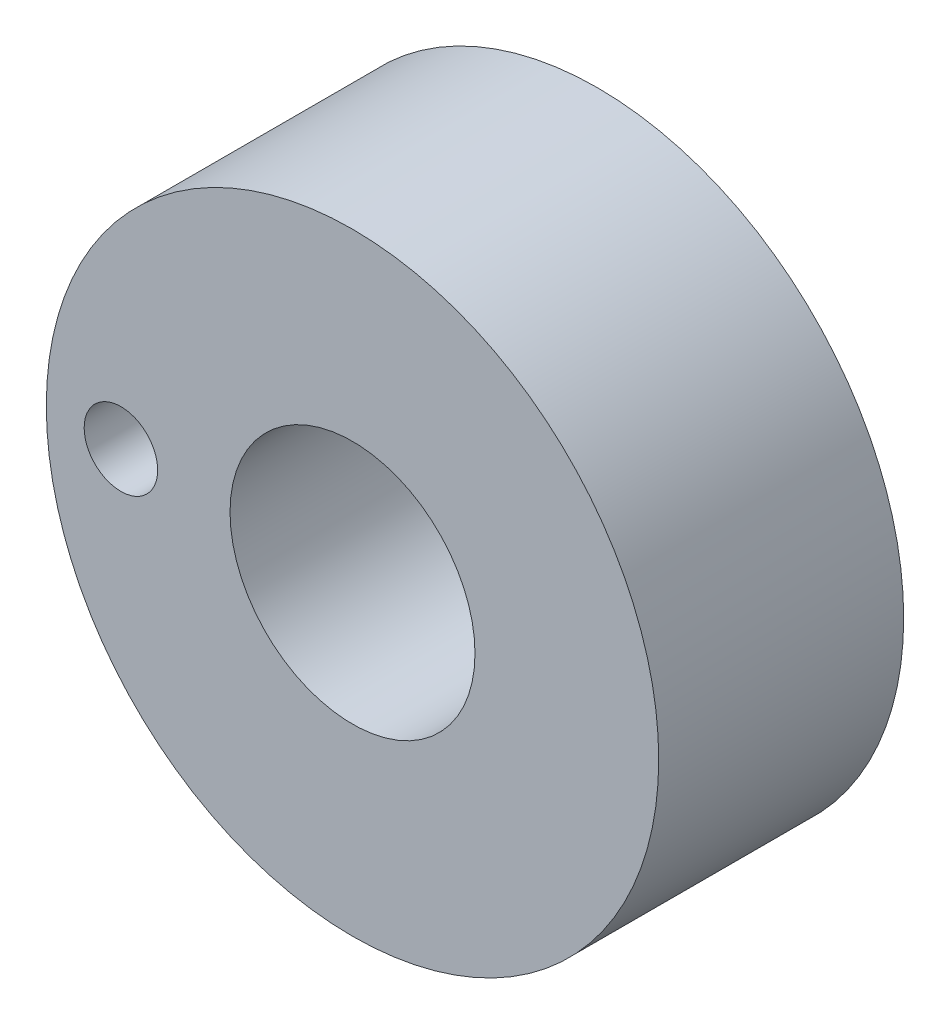
ISO-10303-21;
HEADER;
FILE_DESCRIPTION(('STEP AP214'),'2;1');
FILE_NAME('part.step','',(''),(''),'','','');
FILE_SCHEMA(('AUTOMOTIVE_DESIGN { 1 0 10303 214 1 1 1 1 }'));
ENDSEC;
DATA;
#1=APPLICATION_CONTEXT('core data for automotive mechanical design processes');
#2=APPLICATION_PROTOCOL_DEFINITION('international standard','automotive_design',2000,#1);
#3=PRODUCT_CONTEXT('',#1,'mechanical');
#4=PRODUCT('Part','Part','',(#3));
#5=PRODUCT_RELATED_PRODUCT_CATEGORY('part','',(#4));
#6=PRODUCT_DEFINITION_FORMATION('','',#4);
#7=PRODUCT_DEFINITION_CONTEXT('part definition',#1,'design');
#8=PRODUCT_DEFINITION('design','',#6,#7);
#9=PRODUCT_DEFINITION_SHAPE('','',#8);
#10=(LENGTH_UNIT() NAMED_UNIT(*) SI_UNIT(.MILLI.,.METRE.));
#11=(NAMED_UNIT(*) PLANE_ANGLE_UNIT() SI_UNIT($,.RADIAN.));
#12=(NAMED_UNIT(*) SI_UNIT($,.STERADIAN.) SOLID_ANGLE_UNIT());
#13=UNCERTAINTY_MEASURE_WITH_UNIT(LENGTH_MEASURE(1.E-05),#10,'distance_accuracy_value','');
#14=(GEOMETRIC_REPRESENTATION_CONTEXT(3) GLOBAL_UNCERTAINTY_ASSIGNED_CONTEXT((#13)) GLOBAL_UNIT_ASSIGNED_CONTEXT((#10,
#11,#12)) REPRESENTATION_CONTEXT('',''));
#15=CARTESIAN_POINT('',(0.,0.,0.));
#16=DIRECTION('',(0.,0.,1.));
#17=DIRECTION('',(1.,0.,0.));
#18=AXIS2_PLACEMENT_3D('',#15,#16,#17);
#19=CARTESIAN_POINT('',(0.,0.,20.));
#20=DIRECTION('',(0.,0.,-1.));
#21=DIRECTION('',(-1.,0.,0.));
#22=AXIS2_PLACEMENT_3D('',#19,#20,#21);
#23=CYLINDRICAL_SURFACE('',#22,25.);
#24=CARTESIAN_POINT('',(0.,0.,20.));
#25=DIRECTION('',(0.,0.,1.));
#26=DIRECTION('',(1.,0.,0.));
#27=AXIS2_PLACEMENT_3D('',#24,#25,#26);
#28=CIRCLE('',#27,25.);
#29=CARTESIAN_POINT('',(25.,0.,20.));
#30=VERTEX_POINT('',#29);
#31=EDGE_CURVE('E10',#30,#30,#28,.T.);
#32=ORIENTED_EDGE('',*,*,#31,.F.);
#33=EDGE_LOOP('',(#32));
#34=FACE_BOUND('',#33,.T.);
#35=CARTESIAN_POINT('',(0.,0.,0.));
#36=DIRECTION('',(0.,0.,1.));
#37=DIRECTION('',(1.,0.,0.));
#38=AXIS2_PLACEMENT_3D('',#35,#36,#37);
#39=CIRCLE('',#38,25.);
#40=CARTESIAN_POINT('',(25.,0.,0.));
#41=VERTEX_POINT('',#40);
#42=EDGE_CURVE('E35',#41,#41,#39,.T.);
#43=ORIENTED_EDGE('',*,*,#42,.T.);
#44=EDGE_LOOP('',(#43));
#45=FACE_BOUND('',#44,.T.);
#46=ADVANCED_FACE('F32',(#34,#45),#23,.T.);
#47=CARTESIAN_POINT('',(0.,0.,20.));
#48=DIRECTION('',(0.,0.,1.));
#49=DIRECTION('',(1.,0.,0.));
#50=AXIS2_PLACEMENT_3D('',#47,#48,#49);
#51=PLANE('',#50);
#52=CARTESIAN_POINT('',(0.,0.,20.));
#53=DIRECTION('',(0.,0.,-1.));
#54=DIRECTION('',(-1.,0.,0.));
#55=AXIS2_PLACEMENT_3D('',#52,#53,#54);
#56=CIRCLE('',#55,10.);
#57=CARTESIAN_POINT('',(-10.,0.,20.));
#58=VERTEX_POINT('',#57);
#59=EDGE_CURVE('E42',#58,#58,#56,.T.);
#60=ORIENTED_EDGE('',*,*,#59,.T.);
#61=EDGE_LOOP('',(#60));
#62=FACE_BOUND('',#61,.T.);
#63=CARTESIAN_POINT('',(-18.9082490429939,0.,20.));
#64=DIRECTION('',(0.,0.,-1.));
#65=DIRECTION('',(-1.,0.,0.));
#66=AXIS2_PLACEMENT_3D('',#63,#64,#65);
#67=CIRCLE('',#66,3.);
#68=CARTESIAN_POINT('',(-21.9082490429939,0.,20.));
#69=VERTEX_POINT('',#68);
#70=EDGE_CURVE('E47',#69,#69,#67,.T.);
#71=ORIENTED_EDGE('',*,*,#70,.T.);
#72=EDGE_LOOP('',(#71));
#73=FACE_BOUND('',#72,.T.);
#74=ORIENTED_EDGE('',*,*,#31,.T.);
#75=EDGE_LOOP('',(#74));
#76=FACE_BOUND('',#75,.T.);
#77=ADVANCED_FACE('F56',(#62,#73,#76),#51,.T.);
#78=CARTESIAN_POINT('',(0.,0.,0.));
#79=DIRECTION('',(0.,0.,1.));
#80=DIRECTION('',(1.,0.,0.));
#81=AXIS2_PLACEMENT_3D('',#78,#79,#80);
#82=PLANE('',#81);
#83=CARTESIAN_POINT('',(0.,0.,0.));
#84=DIRECTION('',(0.,0.,-1.));
#85=DIRECTION('',(-1.,0.,0.));
#86=AXIS2_PLACEMENT_3D('',#83,#84,#85);
#87=CIRCLE('',#86,10.);
#88=CARTESIAN_POINT('',(-10.,0.,0.));
#89=VERTEX_POINT('',#88);
#90=EDGE_CURVE('E50',#89,#89,#87,.T.);
#91=ORIENTED_EDGE('',*,*,#90,.F.);
#92=EDGE_LOOP('',(#91));
#93=FACE_BOUND('',#92,.T.);
#94=CARTESIAN_POINT('',(-18.9082490429939,0.,0.));
#95=DIRECTION('',(0.,0.,-1.));
#96=DIRECTION('',(-1.,0.,0.));
#97=AXIS2_PLACEMENT_3D('',#94,#95,#96);
#98=CIRCLE('',#97,3.);
#99=CARTESIAN_POINT('',(-21.9082490429939,0.,0.));
#100=VERTEX_POINT('',#99);
#101=EDGE_CURVE('E44',#100,#100,#98,.T.);
#102=ORIENTED_EDGE('',*,*,#101,.F.);
#103=EDGE_LOOP('',(#102));
#104=FACE_BOUND('',#103,.T.);
#105=ORIENTED_EDGE('',*,*,#42,.F.);
#106=EDGE_LOOP('',(#105));
#107=FACE_BOUND('',#106,.T.);
#108=ADVANCED_FACE('F66',(#93,#104,#107),#82,.F.);
#109=CARTESIAN_POINT('',(-18.9082490429939,0.,20.));
#110=DIRECTION('',(0.,0.,-1.));
#111=DIRECTION('',(-1.,0.,0.));
#112=AXIS2_PLACEMENT_3D('',#109,#110,#111);
#113=CYLINDRICAL_SURFACE('',#112,3.);
#114=ORIENTED_EDGE('',*,*,#70,.F.);
#115=EDGE_LOOP('',(#114));
#116=FACE_BOUND('',#115,.T.);
#117=ORIENTED_EDGE('',*,*,#101,.T.);
#118=EDGE_LOOP('',(#117));
#119=FACE_BOUND('',#118,.T.);
#120=ADVANCED_FACE('F62',(#116,#119),#113,.F.);
#121=CARTESIAN_POINT('',(0.,0.,20.));
#122=DIRECTION('',(0.,0.,-1.));
#123=DIRECTION('',(-1.,0.,0.));
#124=AXIS2_PLACEMENT_3D('',#121,#122,#123);
#125=CYLINDRICAL_SURFACE('',#124,10.);
#126=ORIENTED_EDGE('',*,*,#59,.F.);
#127=EDGE_LOOP('',(#126));
#128=FACE_BOUND('',#127,.T.);
#129=ORIENTED_EDGE('',*,*,#90,.T.);
#130=EDGE_LOOP('',(#129));
#131=FACE_BOUND('',#130,.T.);
#132=ADVANCED_FACE('F59',(#128,#131),#125,.F.);
#133=CLOSED_SHELL('',(#46,#77,#108,#120,#132));
#134=MANIFOLD_SOLID_BREP('B2',#133);
#135=ADVANCED_BREP_SHAPE_REPRESENTATION('',(#18,#134),#14);
#136=SHAPE_DEFINITION_REPRESENTATION(#9,#135);
ENDSEC;
END-ISO-10303-21;
